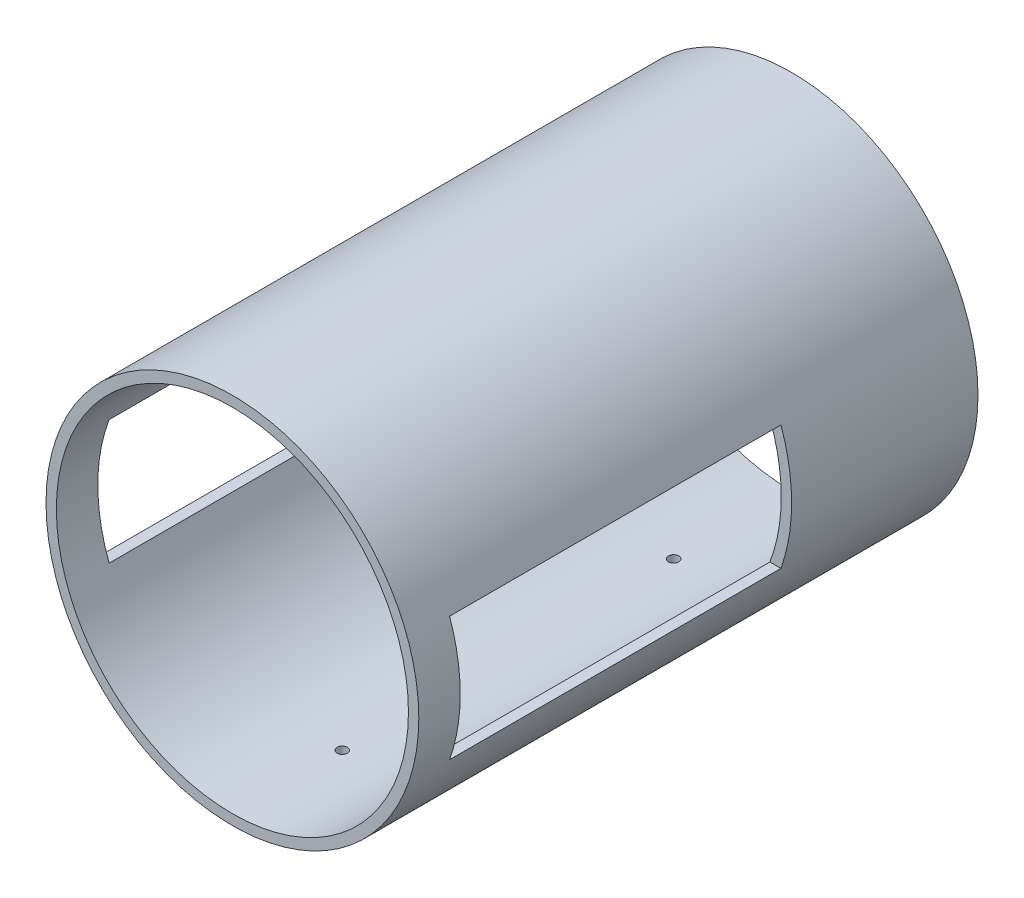
ISO-10303-21;
HEADER;
FILE_DESCRIPTION(('STEP AP214'),'2;1');
FILE_NAME('part.step','',(''),(''),'','','');
FILE_SCHEMA(('AUTOMOTIVE_DESIGN { 1 0 10303 214 1 1 1 1 }'));
ENDSEC;
DATA;
#1=APPLICATION_CONTEXT('core data for automotive mechanical design processes');
#2=APPLICATION_PROTOCOL_DEFINITION('international standard','automotive_design',2000,#1);
#3=PRODUCT_CONTEXT('',#1,'mechanical');
#4=PRODUCT('Part','Part','',(#3));
#5=PRODUCT_RELATED_PRODUCT_CATEGORY('part','',(#4));
#6=PRODUCT_DEFINITION_FORMATION('','',#4);
#7=PRODUCT_DEFINITION_CONTEXT('part definition',#1,'design');
#8=PRODUCT_DEFINITION('design','',#6,#7);
#9=PRODUCT_DEFINITION_SHAPE('','',#8);
#10=(LENGTH_UNIT() NAMED_UNIT(*) SI_UNIT(.MILLI.,.METRE.));
#11=(NAMED_UNIT(*) PLANE_ANGLE_UNIT() SI_UNIT($,.RADIAN.));
#12=(NAMED_UNIT(*) SI_UNIT($,.STERADIAN.) SOLID_ANGLE_UNIT());
#13=UNCERTAINTY_MEASURE_WITH_UNIT(LENGTH_MEASURE(1.E-05),#10,'distance_accuracy_value','');
#14=(GEOMETRIC_REPRESENTATION_CONTEXT(3) GLOBAL_UNCERTAINTY_ASSIGNED_CONTEXT((#13)) GLOBAL_UNIT_ASSIGNED_CONTEXT((#10,
#11,#12)) REPRESENTATION_CONTEXT('',''));
#15=CARTESIAN_POINT('',(0.,0.,0.));
#16=DIRECTION('',(0.,0.,1.));
#17=DIRECTION('',(1.,0.,0.));
#18=AXIS2_PLACEMENT_3D('',#15,#16,#17);
#19=CARTESIAN_POINT('',(0.,0.,270.));
#20=DIRECTION('',(0.,0.,1.));
#21=DIRECTION('',(1.,0.,0.));
#22=AXIS2_PLACEMENT_3D('',#19,#20,#21);
#23=PLANE('',#22);
#24=CARTESIAN_POINT('',(0.,0.,270.));
#25=DIRECTION('',(0.,0.,1.));
#26=DIRECTION('',(1.,0.,0.));
#27=AXIS2_PLACEMENT_3D('',#24,#25,#26);
#28=CIRCLE('',#27,90.);
#29=CARTESIAN_POINT('',(90.,0.,270.));
#30=VERTEX_POINT('',#29);
#31=EDGE_CURVE('E125',#30,#30,#28,.T.);
#32=ORIENTED_EDGE('',*,*,#31,.T.);
#33=EDGE_LOOP('',(#32));
#34=FACE_BOUND('',#33,.T.);
#35=CARTESIAN_POINT('',(0.,0.,270.));
#36=DIRECTION('',(0.,0.,1.));
#37=DIRECTION('',(1.,0.,0.));
#38=AXIS2_PLACEMENT_3D('',#35,#36,#37);
#39=CIRCLE('',#38,85.);
#40=CARTESIAN_POINT('',(85.,0.,270.));
#41=VERTEX_POINT('',#40);
#42=EDGE_CURVE('E229',#41,#41,#39,.T.);
#43=ORIENTED_EDGE('',*,*,#42,.F.);
#44=EDGE_LOOP('',(#43));
#45=FACE_BOUND('',#44,.T.);
#46=ADVANCED_FACE('F41',(#34,#45),#23,.T.);
#47=CARTESIAN_POINT('',(0.,0.,0.));
#48=DIRECTION('',(0.,0.,1.));
#49=DIRECTION('',(1.,0.,0.));
#50=AXIS2_PLACEMENT_3D('',#47,#48,#49);
#51=PLANE('',#50);
#52=CARTESIAN_POINT('',(0.,0.,0.));
#53=DIRECTION('',(0.,0.,1.));
#54=DIRECTION('',(1.,0.,0.));
#55=AXIS2_PLACEMENT_3D('',#52,#53,#54);
#56=CIRCLE('',#55,90.);
#57=CARTESIAN_POINT('',(90.,0.,0.));
#58=VERTEX_POINT('',#57);
#59=EDGE_CURVE('E233',#58,#58,#56,.T.);
#60=ORIENTED_EDGE('',*,*,#59,.F.);
#61=EDGE_LOOP('',(#60));
#62=FACE_BOUND('',#61,.T.);
#63=CARTESIAN_POINT('',(0.,0.,0.));
#64=DIRECTION('',(0.,0.,1.));
#65=DIRECTION('',(1.,0.,0.));
#66=AXIS2_PLACEMENT_3D('',#63,#64,#65);
#67=CIRCLE('',#66,85.);
#68=CARTESIAN_POINT('',(85.,0.,0.));
#69=VERTEX_POINT('',#68);
#70=EDGE_CURVE('E234',#69,#69,#67,.T.);
#71=ORIENTED_EDGE('',*,*,#70,.T.);
#72=EDGE_LOOP('',(#71));
#73=FACE_BOUND('',#72,.T.);
#74=ADVANCED_FACE('F246',(#62,#73),#51,.F.);
#75=CARTESIAN_POINT('',(0.,0.,270.));
#76=DIRECTION('',(0.,0.,-1.));
#77=DIRECTION('',(-1.,0.,0.));
#78=AXIS2_PLACEMENT_3D('',#75,#76,#77);
#79=CYLINDRICAL_SURFACE('',#78,90.);
#80=CARTESIAN_POINT('',(0.,-90.,219.435514150279));
#81=CARTESIAN_POINT('',(0.140397042019154,-89.9999995319438,219.435507933143));
#82=CARTESIAN_POINT('',(0.28089519564269,-89.9996679531089,219.423647656676));
#83=CARTESIAN_POINT('',(0.558020117815433,-89.9983770952561,219.37650036));
#84=CARTESIAN_POINT('',(0.694642052959803,-89.9974170656467,219.341185325815));
#85=CARTESIAN_POINT('',(0.959959719018595,-89.9949780319742,219.248136415119));
#86=CARTESIAN_POINT('',(1.08865927892479,-89.9934992809682,219.1904134688));
#87=CARTESIAN_POINT('',(1.33450554505353,-89.99018962507,219.054202859385));
#88=CARTESIAN_POINT('',(1.45165506934499,-89.9883588064013,218.975720278684));
#89=CARTESIAN_POINT('',(1.6711601515117,-89.9845503358166,218.800179991348));
#90=CARTESIAN_POINT('',(1.77351058430538,-89.9825726333905,218.703115876647));
#91=CARTESIAN_POINT('',(1.96046913805617,-89.9786937420702,218.493178643787));
#92=CARTESIAN_POINT('',(2.04507655381373,-89.9767925562195,218.380304897569));
#93=CARTESIAN_POINT('',(2.19415412545861,-89.9732808620878,218.141935059623));
#94=CARTESIAN_POINT('',(2.25862139660069,-89.9716703954613,218.016437163092));
#95=CARTESIAN_POINT('',(2.36556983153641,-89.9689221774994,217.756394356945));
#96=CARTESIAN_POINT('',(2.40805107723982,-89.9677844244029,217.621849481036));
#97=CARTESIAN_POINT('',(2.46981108294208,-89.9661102723468,217.347568890308));
#98=CARTESIAN_POINT('',(2.48909586382638,-89.9655737173425,217.207834532185));
#99=CARTESIAN_POINT('',(2.5039340546256,-89.9651619902208,216.927110864151));
#100=CARTESIAN_POINT('',(2.49948755185745,-89.9652868156701,216.786121558858));
#101=CARTESIAN_POINT('',(2.46699450942354,-89.9661836277688,216.506931018646));
#102=CARTESIAN_POINT('',(2.43895448450627,-89.9669554357703,216.368729024867));
#103=CARTESIAN_POINT('',(2.36008042398483,-89.9690589248205,216.09899462342));
#104=CARTESIAN_POINT('',(2.30924634192171,-89.9703906070103,215.967462229346));
#105=CARTESIAN_POINT('',(2.18621968912266,-89.9734639286712,215.714779840415));
#106=CARTESIAN_POINT('',(2.11402413154512,-89.9752056254652,215.593631300525));
#107=CARTESIAN_POINT('',(1.95032613265887,-89.9789025714567,215.365171574372));
#108=CARTESIAN_POINT('',(1.8588236546426,-89.9808578210603,215.25786041442));
#109=CARTESIAN_POINT('',(1.65907237374858,-89.9847622498809,215.060083657521));
#110=CARTESIAN_POINT('',(1.5508179195768,-89.9867114268222,214.969623768145));
#111=CARTESIAN_POINT('',(1.32065559128939,-89.9903833377234,214.808161334606));
#112=CARTESIAN_POINT('',(1.19874771503101,-89.9921060716479,214.737158793496));
#113=CARTESIAN_POINT('',(0.944735932127739,-89.9951309143508,214.61662722284));
#114=CARTESIAN_POINT('',(0.812631941112758,-89.9964330196482,214.567098371006));
#115=CARTESIAN_POINT('',(0.541979331555829,-89.9984697645758,214.490923769161));
#116=CARTESIAN_POINT('',(0.403430728095552,-89.999204405534,214.464277965602));
#117=CARTESIAN_POINT('',(0.1238714065411,-90.0000232385431,214.434632832222));
#118=CARTESIAN_POINT('',(-0.017138473529515,-90.0001076478185,214.431625605403));
#119=CARTESIAN_POINT('',(-0.297661115566697,-89.9996170775789,214.449322413365));
#120=CARTESIAN_POINT('',(-0.437173879010674,-89.9990420987148,214.470026424745));
#121=CARTESIAN_POINT('',(-0.710719991671809,-89.9972976964564,214.534551458711));
#122=CARTESIAN_POINT('',(-0.844754186879518,-89.9961283652185,214.578368897522));
#123=CARTESIAN_POINT('',(-1.10356435792478,-89.9933270338481,214.687873322448));
#124=CARTESIAN_POINT('',(-1.22834031798408,-89.9916950329273,214.753560345834));
#125=CARTESIAN_POINT('',(-1.46512841707063,-89.9881516893817,214.904959655067));
#126=CARTESIAN_POINT('',(-1.57713715604541,-89.9862402726533,214.990677256827));
#127=CARTESIAN_POINT('',(-1.78517713978239,-89.9823537725011,215.179696699419));
#128=CARTESIAN_POINT('',(-1.88120834863079,-89.9803786889342,215.282998579773));
#129=CARTESIAN_POINT('',(-2.05459362740716,-89.9765868967821,215.504288031401));
#130=CARTESIAN_POINT('',(-2.13194260177604,-89.9747702314915,215.622279596));
#131=CARTESIAN_POINT('',(-2.26573289500017,-89.9715007780743,215.869578633912));
#132=CARTESIAN_POINT('',(-2.32217425739509,-89.9700479891899,215.998886083659));
#133=CARTESIAN_POINT('',(-2.41253824343585,-89.9676703956174,216.265127115878));
#134=CARTESIAN_POINT('',(-2.4464641689408,-89.9667455135152,216.402059576959));
#135=CARTESIAN_POINT('',(-2.49084507773953,-89.9655277935085,216.679679548046));
#136=CARTESIAN_POINT('',(-2.50130007269339,-89.9652349552901,216.820367056186));
#137=CARTESIAN_POINT('',(-2.49844194655691,-89.96531436789,217.101452416446));
#138=CARTESIAN_POINT('',(-2.4851368682369,-89.9656863936522,217.241850350483));
#139=CARTESIAN_POINT('',(-2.4351528030252,-89.9670531219144,217.518418947146));
#140=CARTESIAN_POINT('',(-2.39847376968867,-89.9680478256517,217.654589601372));
#141=CARTESIAN_POINT('',(-2.30278395447145,-89.9705477446442,217.918841651203));
#142=CARTESIAN_POINT('',(-2.24377279020737,-89.9720529686408,218.046922908252));
#143=CARTESIAN_POINT('',(-2.10509696337443,-89.9754041734411,218.29135727779));
#144=CARTESIAN_POINT('',(-2.02543305682351,-89.9772501417709,218.40771081937));
#145=CARTESIAN_POINT('',(-1.84769084148879,-89.9810753429325,218.625422993322));
#146=CARTESIAN_POINT('',(-1.74960826485271,-89.9830546065823,218.726778140613));
#147=CARTESIAN_POINT('',(-1.5377908144063,-89.9869234655456,218.911610946133));
#148=CARTESIAN_POINT('',(-1.42405206882742,-89.9888130385225,218.99508416907));
#149=CARTESIAN_POINT('',(-1.18410995481811,-89.992290110815,219.141795849157));
#150=CARTESIAN_POINT('',(-1.05789885588763,-89.9938774209784,219.20502165249));
#151=CARTESIAN_POINT('',(-0.796746320585507,-89.996567579422,219.309312727654));
#152=CARTESIAN_POINT('',(-0.66181551949931,-89.9976710055542,219.350404445371));
#153=CARTESIAN_POINT('',(-0.438359413069992,-89.9989739129089,219.398362357061));
#154=CARTESIAN_POINT('',(-0.351284744204209,-89.9993570277234,219.412276769779));
#155=CARTESIAN_POINT('',(-0.176153320392806,-89.9998702180854,219.430854615793));
#156=CARTESIAN_POINT('',(-0.0880965656943918,-90.0000002936967,219.435518051418));
#157=CARTESIAN_POINT('',(0.,-90.,219.435514150279));
#158=B_SPLINE_CURVE_WITH_KNOTS('',3,(#80,#81,#82,#83,#84,#85,#86,#87,#88,#89,#90,#91,#92,#93,
#94,#95,#96,#97,#98,#99,#100,#101,#102,#103,#104,#105,#106,#107,#108,#109,#110,#111,#112,#113,
#114,#115,#116,#117,#118,#119,#120,#121,#122,#123,#124,#125,#126,#127,#128,#129,#130,#131,#132,
#133,#134,#135,#136,#137,#138,#139,#140,#141,#142,#143,#144,#145,#146,#147,#148,#149,#150,#151,
#152,#153,#154,#155,#156,#157),.UNSPECIFIED.,.T.,.F.,(4,2,2,2,2,2,2,2,2,2,2,2,2,2,2,2,2,2,2,2,2,
2,2,2,2,2,2,2,2,2,2,2,2,2,2,2,2,2,4),(0.,0.42086956381158,0.842242713432001,1.26341058226418,
1.68447543560223,2.10568576067631,2.52691282366281,2.94820019288202,3.36948599256813,
3.79066241949896,4.2118372967533,4.6328959154729,5.05395539239963,5.47507377128557,
5.89619295083596,6.31745450627262,6.7387161278217,7.15998123557068,7.58124535752536,
8.0023687407638,8.42349170838378,8.84454939937653,9.26560780793642,9.6867780883187,
10.1079493153823,10.5292352870451,10.9505203813834,11.3717436811591,11.7929667716759,
12.2140473054589,12.6351286759459,13.0562172567528,13.4772904252921,13.898461282779,
14.3197364835173,14.7412744527206,15.1623076433261,15.4263956324784,15.6904835551573),.UNSPECIFIED.);
#159=CARTESIAN_POINT('',(0.,-90.,219.435514150279));
#160=VERTEX_POINT('',#159);
#161=EDGE_CURVE('E188',#160,#160,#158,.T.);
#162=ORIENTED_EDGE('',*,*,#161,.T.);
#163=EDGE_LOOP('',(#162));
#164=FACE_BOUND('',#163,.T.);
#165=CARTESIAN_POINT('',(0.,-90.,59.4355141502788));
#166=CARTESIAN_POINT('',(0.140397042019179,-89.9999995319438,59.4355079331427));
#167=CARTESIAN_POINT('',(0.280895195642714,-89.9996679531089,59.4236476566764));
#168=CARTESIAN_POINT('',(0.558020117815458,-89.9983770952561,59.3765003599996));
#169=CARTESIAN_POINT('',(0.694642052959831,-89.9974170656467,59.3411853258147));
#170=CARTESIAN_POINT('',(0.959959719018621,-89.9949780319742,59.248136415119));
#171=CARTESIAN_POINT('',(1.08865927892481,-89.9934992809682,59.1904134688002));
#172=CARTESIAN_POINT('',(1.33450554505355,-89.99018962507,59.0542028593846));
#173=CARTESIAN_POINT('',(1.45165506934501,-89.9883588064013,58.9757202786841));
#174=CARTESIAN_POINT('',(1.67116015151172,-89.9845503358166,58.8001799913483));
#175=CARTESIAN_POINT('',(1.77351058430539,-89.9825726333905,58.703115876647));
#176=CARTESIAN_POINT('',(1.96046913805619,-89.9786937420702,58.4931786437872));
#177=CARTESIAN_POINT('',(2.04507655381375,-89.9767925562195,58.3803048975693));
#178=CARTESIAN_POINT('',(2.19415412545864,-89.9732808620878,58.1419350596226));
#179=CARTESIAN_POINT('',(2.25862139660071,-89.9716703954613,58.0164371630917));
#180=CARTESIAN_POINT('',(2.36556983153643,-89.9689221774994,57.756394356945));
#181=CARTESIAN_POINT('',(2.40805107723984,-89.9677844244029,57.6218494810362));
#182=CARTESIAN_POINT('',(2.46981108294211,-89.9661102723468,57.3475688903084));
#183=CARTESIAN_POINT('',(2.48909586382641,-89.9655737173425,57.2078345321853));
#184=CARTESIAN_POINT('',(2.50393405462562,-89.9651619902208,56.9271108641506));
#185=CARTESIAN_POINT('',(2.49948755185748,-89.9652868156701,56.7861215588583));
#186=CARTESIAN_POINT('',(2.46699450942357,-89.9661836277688,56.5069310186462));
#187=CARTESIAN_POINT('',(2.4389544845063,-89.9669554357703,56.3687290248672));
#188=CARTESIAN_POINT('',(2.36008042398485,-89.9690589248205,56.0989946234199));
#189=CARTESIAN_POINT('',(2.30924634192173,-89.9703906070103,55.9674622293463));
#190=CARTESIAN_POINT('',(2.18621968912268,-89.9734639286712,55.7147798404153));
#191=CARTESIAN_POINT('',(2.11402413154515,-89.9752056254652,55.5936313005246));
#192=CARTESIAN_POINT('',(1.9503261326589,-89.9789025714567,55.3651715743723));
#193=CARTESIAN_POINT('',(1.85882365464264,-89.9808578210603,55.2578604144198));
#194=CARTESIAN_POINT('',(1.65907237374862,-89.9847622498809,55.0600836575209));
#195=CARTESIAN_POINT('',(1.55081791957684,-89.9867114268221,54.969623768145));
#196=CARTESIAN_POINT('',(1.32065559128943,-89.9903833377234,54.8081613346056));
#197=CARTESIAN_POINT('',(1.19874771503104,-89.9921060716479,54.7371587934956));
#198=CARTESIAN_POINT('',(0.944735932127776,-89.9951309143508,54.6166272228401));
#199=CARTESIAN_POINT('',(0.812631941112797,-89.9964330196482,54.5670983710059));
#200=CARTESIAN_POINT('',(0.541979331555867,-89.9984697645758,54.490923769161));
#201=CARTESIAN_POINT('',(0.403430728095588,-89.999204405534,54.4642779656022));
#202=CARTESIAN_POINT('',(0.123871406541134,-90.0000232385431,54.4346328322216));
#203=CARTESIAN_POINT('',(-0.0171384735294825,-90.0001076478185,54.4316256054028));
#204=CARTESIAN_POINT('',(-0.297661115566666,-89.9996170775789,54.4493224133654));
#205=CARTESIAN_POINT('',(-0.437173879010643,-89.9990420987148,54.4700264247455));
#206=CARTESIAN_POINT('',(-0.710719991671778,-89.9972976964564,54.5345514587113));
#207=CARTESIAN_POINT('',(-0.844754186879487,-89.9961283652185,54.5783688975219));
#208=CARTESIAN_POINT('',(-1.10356435792475,-89.9933270338481,54.6878733224483));
#209=CARTESIAN_POINT('',(-1.22834031798405,-89.9916950329273,54.7535603458341));
#210=CARTESIAN_POINT('',(-1.4651284170706,-89.9881516893817,54.9049596550668));
#211=CARTESIAN_POINT('',(-1.57713715604537,-89.9862402726533,54.9906772568275));
#212=CARTESIAN_POINT('',(-1.78517713978236,-89.9823537725011,55.1796966994186));
#213=CARTESIAN_POINT('',(-1.88120834863076,-89.9803786889342,55.2829985797734));
#214=CARTESIAN_POINT('',(-2.05459362740713,-89.9765868967821,55.5042880314008));
#215=CARTESIAN_POINT('',(-2.13194260177601,-89.9747702314915,55.6222795960003));
#216=CARTESIAN_POINT('',(-2.26573289500014,-89.9715007780743,55.869578633912));
#217=CARTESIAN_POINT('',(-2.32217425739506,-89.9700479891899,55.9988860836586));
#218=CARTESIAN_POINT('',(-2.41253824343582,-89.9676703956174,56.2651271158778));
#219=CARTESIAN_POINT('',(-2.44646416894077,-89.9667455135152,56.402059576959));
#220=CARTESIAN_POINT('',(-2.4908450777395,-89.9655277935085,56.6796795480457));
#221=CARTESIAN_POINT('',(-2.50130007269336,-89.9652349552901,56.8203670561858));
#222=CARTESIAN_POINT('',(-2.49844194655688,-89.96531436789,57.1014524164465));
#223=CARTESIAN_POINT('',(-2.48513686823687,-89.9656863936522,57.2418503504828));
#224=CARTESIAN_POINT('',(-2.43515280302518,-89.9670531219144,57.5184189471457));
#225=CARTESIAN_POINT('',(-2.39847376968864,-89.9680478256517,57.654589601372));
#226=CARTESIAN_POINT('',(-2.30278395447142,-89.9705477446442,57.9188416512026));
#227=CARTESIAN_POINT('',(-2.24377279020734,-89.9720529686408,58.0469229082518));
#228=CARTESIAN_POINT('',(-2.1050969633744,-89.9754041734411,58.2913572777903));
#229=CARTESIAN_POINT('',(-2.02543305682349,-89.9772501417709,58.4077108193699));
#230=CARTESIAN_POINT('',(-1.84769084148878,-89.9810753429325,58.6254229933216));
#231=CARTESIAN_POINT('',(-1.74960826485269,-89.9830546065823,58.7267781406132));
#232=CARTESIAN_POINT('',(-1.53779081440628,-89.9869234655456,58.9116109461328));
#233=CARTESIAN_POINT('',(-1.42405206882739,-89.9888130385225,58.9950841690696));
#234=CARTESIAN_POINT('',(-1.18410995481808,-89.992290110815,59.1417958491572));
#235=CARTESIAN_POINT('',(-1.0578988558876,-89.9938774209784,59.2050216524902));
#236=CARTESIAN_POINT('',(-0.796746320585478,-89.996567579422,59.3093127276544));
#237=CARTESIAN_POINT('',(-0.661815519499278,-89.9976710055542,59.3504044453708));
#238=CARTESIAN_POINT('',(-0.43835941306996,-89.9989739129089,59.3983623570611));
#239=CARTESIAN_POINT('',(-0.351284744204177,-89.9993570277234,59.4122767697793));
#240=CARTESIAN_POINT('',(-0.176153320392776,-89.9998702180854,59.4308546157932));
#241=CARTESIAN_POINT('',(-0.0880965656943635,-90.0000002936967,59.4355180514176));
#242=CARTESIAN_POINT('',(0.,-90.,59.4355141502788));
#243=B_SPLINE_CURVE_WITH_KNOTS('',3,(#165,#166,#167,#168,#169,#170,#171,#172,#173,#174,#175,
#176,#177,#178,#179,#180,#181,#182,#183,#184,#185,#186,#187,#188,#189,#190,#191,#192,#193,#194,
#195,#196,#197,#198,#199,#200,#201,#202,#203,#204,#205,#206,#207,#208,#209,#210,#211,#212,#213,
#214,#215,#216,#217,#218,#219,#220,#221,#222,#223,#224,#225,#226,#227,#228,#229,#230,#231,#232,
#233,#234,#235,#236,#237,#238,#239,#240,#241,#242),.UNSPECIFIED.,.T.,.F.,(4,2,2,2,2,2,2,2,2,2,2,
2,2,2,2,2,2,2,2,2,2,2,2,2,2,2,2,2,2,2,2,2,2,2,2,2,2,2,4),(0.,0.420869563811578,
0.842242713431999,1.26341058226417,1.68447543560222,2.10568576067627,2.52691282366281,
2.94820019288202,3.36948599256812,3.79066241949895,4.21183729675328,4.63289591547289,
5.05395539239966,5.47507377128554,5.89619295083594,6.3174545062726,6.73871612782169,
7.15998123557066,7.58124535752535,8.00236874076379,8.42349170838378,8.84454939937653,
9.26560780793641,9.68677808831869,10.1079493153823,10.529235287045,10.9505203813834,
11.3717436811591,11.7929667716759,12.2140473054589,12.6351286759459,13.0562172567528,
13.4772904252921,13.898461282779,14.3197364835173,14.7412744527206,15.1623076433261,
15.4263956324784,15.6904835551572),.UNSPECIFIED.);
#244=CARTESIAN_POINT('',(0.,-90.,59.4355141502788));
#245=VERTEX_POINT('',#244);
#246=EDGE_CURVE('E166',#245,#245,#243,.T.);
#247=ORIENTED_EDGE('',*,*,#246,.T.);
#248=EDGE_LOOP('',(#247));
#249=FACE_BOUND('',#248,.T.);
#250=DIRECTION('',(0.,0.,-1.));
#251=VECTOR('',#250,1.);
#252=CARTESIAN_POINT('',(-84.8528137423857,30.,270.));
#253=LINE('',#252,#251);
#254=CARTESIAN_POINT('',(-84.8528137423857,30.,90.));
#255=VERTEX_POINT('',#254);
#256=CARTESIAN_POINT('',(-84.8528137423857,30.,250.));
#257=VERTEX_POINT('',#256);
#258=EDGE_CURVE('E207',#255,#257,#253,.F.);
#259=ORIENTED_EDGE('',*,*,#258,.T.);
#260=CARTESIAN_POINT('',(0.,0.,250.));
#261=DIRECTION('',(0.,0.,1.));
#262=DIRECTION('',(1.,0.,0.));
#263=AXIS2_PLACEMENT_3D('',#260,#261,#262);
#264=CIRCLE('',#263,90.);
#265=CARTESIAN_POINT('',(-84.8528137423857,-30.,250.));
#266=VERTEX_POINT('',#265);
#267=EDGE_CURVE('E131',#257,#266,#264,.T.);
#268=ORIENTED_EDGE('',*,*,#267,.T.);
#269=DIRECTION('',(0.,0.,-1.));
#270=VECTOR('',#269,1.);
#271=CARTESIAN_POINT('',(-84.8528137423857,-30.,270.));
#272=LINE('',#271,#270);
#273=CARTESIAN_POINT('',(-84.8528137423857,-30.,90.));
#274=VERTEX_POINT('',#273);
#275=EDGE_CURVE('E221',#266,#274,#272,.T.);
#276=ORIENTED_EDGE('',*,*,#275,.T.);
#277=CARTESIAN_POINT('',(0.,0.,90.));
#278=DIRECTION('',(0.,0.,-1.));
#279=DIRECTION('',(-1.,0.,0.));
#280=AXIS2_PLACEMENT_3D('',#277,#278,#279);
#281=CIRCLE('',#280,90.);
#282=EDGE_CURVE('E225',#274,#255,#281,.T.);
#283=ORIENTED_EDGE('',*,*,#282,.T.);
#284=EDGE_LOOP('',(#259,#268,#276,#283));
#285=FACE_BOUND('',#284,.T.);
#286=CARTESIAN_POINT('',(84.8528137423857,-30.,250.));
#287=VERTEX_POINT('',#286);
#288=CARTESIAN_POINT('',(84.8528137423857,30.,250.));
#289=VERTEX_POINT('',#288);
#290=EDGE_CURVE('E214',#287,#289,#264,.T.);
#291=ORIENTED_EDGE('',*,*,#290,.T.);
#292=DIRECTION('',(0.,0.,-1.));
#293=VECTOR('',#292,1.);
#294=CARTESIAN_POINT('',(84.8528137423857,30.,270.));
#295=LINE('',#294,#293);
#296=CARTESIAN_POINT('',(84.8528137423857,30.,90.));
#297=VERTEX_POINT('',#296);
#298=EDGE_CURVE('E210',#289,#297,#295,.T.);
#299=ORIENTED_EDGE('',*,*,#298,.T.);
#300=CARTESIAN_POINT('',(84.8528137423857,-30.,90.));
#301=VERTEX_POINT('',#300);
#302=EDGE_CURVE('E228',#297,#301,#281,.T.);
#303=ORIENTED_EDGE('',*,*,#302,.T.);
#304=DIRECTION('',(0.,0.,-1.));
#305=VECTOR('',#304,1.);
#306=CARTESIAN_POINT('',(84.8528137423857,-30.,270.));
#307=LINE('',#306,#305);
#308=EDGE_CURVE('E217',#301,#287,#307,.F.);
#309=ORIENTED_EDGE('',*,*,#308,.T.);
#310=EDGE_LOOP('',(#291,#299,#303,#309));
#311=FACE_BOUND('',#310,.T.);
#312=ORIENTED_EDGE('',*,*,#31,.F.);
#313=EDGE_LOOP('',(#312));
#314=FACE_BOUND('',#313,.T.);
#315=ORIENTED_EDGE('',*,*,#59,.T.);
#316=EDGE_LOOP('',(#315));
#317=FACE_BOUND('',#316,.T.);
#318=ADVANCED_FACE('F43',(#164,#249,#285,#311,#314,#317),#79,.T.);
#319=CARTESIAN_POINT('',(0.,0.,270.));
#320=DIRECTION('',(0.,0.,-1.));
#321=DIRECTION('',(-1.,0.,0.));
#322=AXIS2_PLACEMENT_3D('',#319,#320,#321);
#323=CYLINDRICAL_SURFACE('',#322,85.);
#324=CARTESIAN_POINT('',(0.,-85.,219.435514150279));
#325=CARTESIAN_POINT('',(0.140393524378718,-84.9999995046087,219.435507934379));
#326=CARTESIAN_POINT('',(0.280888074295993,-84.9996484389132,219.423648249884));
#327=CARTESIAN_POINT('',(0.558005647093424,-84.9982817174873,219.376503441611));
#328=CARTESIAN_POINT('',(0.6946238404061,-84.9972652676845,219.341190327673));
#329=CARTESIAN_POINT('',(0.959934004017298,-84.9946828896954,219.248146817463));
#330=CARTESIAN_POINT('',(1.08862981263497,-84.9931172300984,219.190427377466));
#331=CARTESIAN_POINT('',(1.33446931951486,-84.9896130414957,219.054225346306));
#332=CARTESIAN_POINT('',(1.45161583025469,-84.9876746036098,218.975747827367));
#333=CARTESIAN_POINT('',(1.67111944140127,-84.9836421661362,218.800216378568));
#334=CARTESIAN_POINT('',(1.77347098481321,-84.9815481085425,218.703155500447));
#335=CARTESIAN_POINT('',(1.96043256823564,-84.9774409572996,218.493224549413));
#336=CARTESIAN_POINT('',(2.04504190204469,-84.9754278668758,218.380353847515));
#337=CARTESIAN_POINT('',(2.19412564280934,-84.971709380369,218.141987057607));
#338=CARTESIAN_POINT('',(2.25859676954662,-84.9700040344322,218.016488917171));
#339=CARTESIAN_POINT('',(2.36555262144571,-84.9670938648566,217.75644432575));
#340=CARTESIAN_POINT('',(2.40803743309319,-84.965889039249,217.621897910359));
#341=CARTESIAN_POINT('',(2.46980287379754,-84.9641161803548,217.34761750535));
#342=CARTESIAN_POINT('',(2.48909025786776,-84.9635479616936,217.207885038117));
#343=CARTESIAN_POINT('',(2.50393415065727,-84.9631118280154,216.927164579524));
#344=CARTESIAN_POINT('',(2.4994907520903,-84.9632439102623,216.786176593071));
#345=CARTESIAN_POINT('',(2.46700493241115,-84.964193311098,216.506993058965));
#346=CARTESIAN_POINT('',(2.43896981673905,-84.9650104175611,216.368796660429));
#347=CARTESIAN_POINT('',(2.36010767528186,-84.9672374203735,216.099072623631));
#348=CARTESIAN_POINT('',(2.30928060033579,-84.9686473180014,215.967544999755));
#349=CARTESIAN_POINT('',(2.18626895522427,-84.9719012105581,215.714868626174));
#350=CARTESIAN_POINT('',(2.11408103649143,-84.9737452735381,215.59372150758));
#351=CARTESIAN_POINT('',(1.95039935241671,-84.9776595432146,215.36526298009));
#352=CARTESIAN_POINT('',(1.85890554498096,-84.9797297504042,215.257951601361));
#353=CARTESIAN_POINT('',(1.65916792957406,-84.9838638777928,215.060168168089));
#354=CARTESIAN_POINT('',(1.55091778578672,-84.9859277953115,214.969702511782));
#355=CARTESIAN_POINT('',(1.32076268672098,-84.9898159191188,214.808227785574));
#356=CARTESIAN_POINT('',(1.19885772924848,-84.9916401253689,214.737218718799));
#357=CARTESIAN_POINT('',(0.94484990976242,-84.9948432124487,214.616673591062));
#358=CARTESIAN_POINT('',(0.81274695249688,-84.9962220891182,214.567137730692));
#359=CARTESIAN_POINT('',(0.54209467692989,-84.9983790138624,214.490949248888));
#360=CARTESIAN_POINT('',(0.403545375506728,-84.99915706351,214.464296567542));
#361=CARTESIAN_POINT('',(0.123988938954878,-85.000024427324,214.434638858802));
#362=CARTESIAN_POINT('',(-0.017017256240174,-85.0001139993243,214.4316249787));
#363=CARTESIAN_POINT('',(-0.297533629735388,-84.9995949937803,214.449307356835));
#364=CARTESIAN_POINT('',(-0.437043809699055,-84.9989864170123,214.470003588704));
#365=CARTESIAN_POINT('',(-0.71058326526739,-84.9971398685405,214.534511370932));
#366=CARTESIAN_POINT('',(-0.844613489435591,-84.9959020062667,214.578318902388));
#367=CARTESIAN_POINT('',(-1.10341750203545,-84.992936378084,214.687801662257));
#368=CARTESIAN_POINT('',(-1.22819127264489,-84.991208611232,214.753476932771));
#369=CARTESIAN_POINT('',(-1.46498123802067,-84.9874571731599,214.904853677523));
#370=CARTESIAN_POINT('',(-1.5769936224216,-84.9854334139707,214.990561109885));
#371=CARTESIAN_POINT('',(-1.78504291778981,-84.9813183650636,215.179560504158));
#372=CARTESIAN_POINT('',(-1.88107978927005,-84.9792270751788,215.282852509532));
#373=CARTESIAN_POINT('',(-2.05448146308617,-84.9752119890713,215.504126888893));
#374=CARTESIAN_POINT('',(-2.13184055281938,-84.973288244207,215.622113740619));
#375=CARTESIAN_POINT('',(-2.26565165005376,-84.9698259509516,215.869405718671));
#376=CARTESIAN_POINT('',(-2.32210370368157,-84.9682874017106,215.998710820025));
#377=CARTESIAN_POINT('',(-2.41248825841417,-84.9657693348592,216.264947282662));
#378=CARTESIAN_POINT('',(-2.44642445761801,-84.9647897254499,216.401877387575));
#379=CARTESIAN_POINT('',(-2.49082610452918,-84.9634997290064,216.679494730472));
#380=CARTESIAN_POINT('',(-2.50129157044439,-84.963189341453,216.820181965542));
#381=CARTESIAN_POINT('',(-2.49845424187916,-84.9632728173662,217.101262750383));
#382=CARTESIAN_POINT('',(-2.4851604596561,-84.9636664138006,217.241656391296));
#383=CARTESIAN_POINT('',(-2.4352005252155,-84.9651129256759,217.518218228123));
#384=CARTESIAN_POINT('',(-2.39853432663588,-84.9661658424245,217.654386415654));
#385=CARTESIAN_POINT('',(-2.30287157861962,-84.9688122595352,217.918635572918));
#386=CARTESIAN_POINT('',(-2.24387465356548,-84.9704057689903,218.046716406574));
#387=CARTESIAN_POINT('',(-2.10522837096703,-84.9739536634928,218.291152562135));
#388=CARTESIAN_POINT('',(-2.02557976276147,-84.9759080354457,218.407508309266));
#389=CARTESIAN_POINT('',(-1.84786492977962,-84.9799580775022,218.625232536078));
#390=CARTESIAN_POINT('',(-1.74979368738697,-84.9820537860005,218.726596919212));
#391=CARTESIAN_POINT('',(-1.53799721863001,-84.986150390389,218.911450223605));
#392=CARTESIAN_POINT('',(-1.42426812157843,-84.9881512626704,218.994934711798));
#393=CARTESIAN_POINT('',(-1.18434076631099,-84.9918333227626,219.141672059435));
#394=CARTESIAN_POINT('',(-1.05813455489749,-84.9935143046453,219.204911904229));
#395=CARTESIAN_POINT('',(-0.796988637653374,-84.9963633884489,219.309231516562));
#396=CARTESIAN_POINT('',(-0.66205956488956,-84.9975321017797,219.350337714829));
#397=CARTESIAN_POINT('',(-0.438564897759322,-84.9989125335872,219.398327261096));
#398=CARTESIAN_POINT('',(-0.351450023475598,-84.9993185645565,219.412254803365));
#399=CARTESIAN_POINT('',(-0.17623670486416,-84.9998624532269,219.430850197801));
#400=CARTESIAN_POINT('',(-0.0881382608146928,-85.0000003110039,219.435518052586));
#401=CARTESIAN_POINT('',(0.,-85.,219.435514150279));
#402=B_SPLINE_CURVE_WITH_KNOTS('',3,(#324,#325,#326,#327,#328,#329,#330,#331,#332,#333,#334,
#335,#336,#337,#338,#339,#340,#341,#342,#343,#344,#345,#346,#347,#348,#349,#350,#351,#352,#353,
#354,#355,#356,#357,#358,#359,#360,#361,#362,#363,#364,#365,#366,#367,#368,#369,#370,#371,#372,
#373,#374,#375,#376,#377,#378,#379,#380,#381,#382,#383,#384,#385,#386,#387,#388,#389,#390,#391,
#392,#393,#394,#395,#396,#397,#398,#399,#400,#401),.UNSPECIFIED.,.T.,.F.,(4,2,2,2,2,2,2,2,2,2,2,
2,2,2,2,2,2,2,2,2,2,2,2,2,2,2,2,2,2,2,2,2,2,2,2,2,2,2,4),(0.,0.420858857472669,
0.842220887644194,1.26337713865914,1.68443057532394,2.10564175114651,2.52686968945313,
2.94816620387193,3.36946106106013,3.79063320886887,4.21180371120217,4.63284384133271,
5.05388487962771,5.4749919561326,5.89609995081406,6.3173675633055,6.73863524348752,
7.1599068588956,7.58117737136182,8.002290110894,8.42340238211804,8.84444144880001,
9.26548132612255,9.68664659219764,10.1078128992605,10.529107857394,10.9504018860301,
11.3716267024147,11.792851192026,12.2139159384569,12.6349815201246,13.0560541847072,
13.4771115729601,13.8982838077482,14.3195603456484,14.7411071677547,15.1621494802117,
15.426362366124,15.6905751772936),.UNSPECIFIED.);
#403=CARTESIAN_POINT('',(0.,-85.,219.435514150279));
#404=VERTEX_POINT('',#403);
#405=EDGE_CURVE('E46',#404,#404,#402,.T.);
#406=ORIENTED_EDGE('',*,*,#405,.F.);
#407=EDGE_LOOP('',(#406));
#408=FACE_BOUND('',#407,.T.);
#409=CARTESIAN_POINT('',(0.,-85.,59.4355141502788));
#410=CARTESIAN_POINT('',(0.140393524378745,-84.9999995046087,59.4355079343792));
#411=CARTESIAN_POINT('',(0.280888074296019,-84.9996484389132,59.4236482498842));
#412=CARTESIAN_POINT('',(0.558005647093451,-84.9982817174873,59.3765034416111));
#413=CARTESIAN_POINT('',(0.694623840406127,-84.9972652676845,59.3411903276726));
#414=CARTESIAN_POINT('',(0.959934004017317,-84.9946828896954,59.2481468174625));
#415=CARTESIAN_POINT('',(1.08862981263498,-84.9931172300984,59.1904273774658));
#416=CARTESIAN_POINT('',(1.33446931951488,-84.9896130414957,59.0542253463064));
#417=CARTESIAN_POINT('',(1.45161583025472,-84.9876746036098,58.9757478273671));
#418=CARTESIAN_POINT('',(1.67111944140129,-84.9836421661362,58.8002163785685));
#419=CARTESIAN_POINT('',(1.77347098481323,-84.9815481085425,58.7031555004465));
#420=CARTESIAN_POINT('',(1.96043256823566,-84.9774409572996,58.4932245494135));
#421=CARTESIAN_POINT('',(2.04504190204471,-84.9754278668758,58.3803538475148));
#422=CARTESIAN_POINT('',(2.19412564280936,-84.971709380369,58.1419870576074));
#423=CARTESIAN_POINT('',(2.25859676954664,-84.9700040344322,58.0164889171712));
#424=CARTESIAN_POINT('',(2.36555262144573,-84.9670938648566,57.7564443257498));
#425=CARTESIAN_POINT('',(2.40803743309321,-84.965889039249,57.6218979103594));
#426=CARTESIAN_POINT('',(2.46980287379757,-84.9641161803548,57.3476175053505));
#427=CARTESIAN_POINT('',(2.48909025786779,-84.9635479616936,57.2078850381167));
#428=CARTESIAN_POINT('',(2.5039341506573,-84.9631118280154,56.9271645795235));
#429=CARTESIAN_POINT('',(2.49949075209033,-84.9632439102623,56.7861765930714));
#430=CARTESIAN_POINT('',(2.46700493241117,-84.964193311098,56.5069930589654));
#431=CARTESIAN_POINT('',(2.43896981673907,-84.9650104175611,56.3687966604288));
#432=CARTESIAN_POINT('',(2.36010767528189,-84.9672374203735,56.0990726236312));
#433=CARTESIAN_POINT('',(2.30928060033581,-84.9686473180014,55.9675449997548));
#434=CARTESIAN_POINT('',(2.18626895522431,-84.9719012105581,55.7148686261737));
#435=CARTESIAN_POINT('',(2.11408103649147,-84.9737452735381,55.5937215075798));
#436=CARTESIAN_POINT('',(1.95039935241676,-84.9776595432146,55.3652629800895));
#437=CARTESIAN_POINT('',(1.858905544981,-84.9797297504042,55.257951601361));
#438=CARTESIAN_POINT('',(1.65916792957409,-84.9838638777928,55.0601681680888));
#439=CARTESIAN_POINT('',(1.55091778578676,-84.9859277953115,54.9697025117817));
#440=CARTESIAN_POINT('',(1.32076268672102,-84.9898159191188,54.8082277855738));
#441=CARTESIAN_POINT('',(1.19885772924852,-84.9916401253689,54.7372187187994));
#442=CARTESIAN_POINT('',(0.944849909762459,-84.9948432124487,54.6166735910617));
#443=CARTESIAN_POINT('',(0.812746952496915,-84.9962220891182,54.5671377306924));
#444=CARTESIAN_POINT('',(0.54209467692992,-84.9983790138624,54.4909492488878));
#445=CARTESIAN_POINT('',(0.403545375506756,-84.99915706351,54.4642965675416));
#446=CARTESIAN_POINT('',(0.123988938954905,-85.000024427324,54.4346388588019));
#447=CARTESIAN_POINT('',(-0.0170172562401469,-85.0001139993243,54.4316249787004));
#448=CARTESIAN_POINT('',(-0.297533629735362,-84.9995949937803,54.4493073568349));
#449=CARTESIAN_POINT('',(-0.43704380969903,-84.9989864170123,54.4700035887036));
#450=CARTESIAN_POINT('',(-0.710583265267365,-84.9971398685405,54.5345113709321));
#451=CARTESIAN_POINT('',(-0.844613489435565,-84.9959020062667,54.5783189023883));
#452=CARTESIAN_POINT('',(-1.10341750203543,-84.992936378084,54.6878016622567));
#453=CARTESIAN_POINT('',(-1.22819127264486,-84.991208611232,54.7534769327715));
#454=CARTESIAN_POINT('',(-1.46498123802064,-84.9874571731599,54.9048536775232));
#455=CARTESIAN_POINT('',(-1.57699362242158,-84.9854334139707,54.9905611098854));
#456=CARTESIAN_POINT('',(-1.78504291778978,-84.9813183650636,55.1795605041583));
#457=CARTESIAN_POINT('',(-1.88107978927003,-84.9792270751788,55.282852509532));
#458=CARTESIAN_POINT('',(-2.05448146308614,-84.9752119890713,55.5041268888933));
#459=CARTESIAN_POINT('',(-2.13184055281935,-84.973288244207,55.6221137406191));
#460=CARTESIAN_POINT('',(-2.26565165005373,-84.9698259509516,55.869405718671));
#461=CARTESIAN_POINT('',(-2.32210370368154,-84.9682874017106,55.998710820025));
#462=CARTESIAN_POINT('',(-2.41248825841414,-84.9657693348592,56.2649472826615));
#463=CARTESIAN_POINT('',(-2.44642445761797,-84.9647897254499,56.4018773875746));
#464=CARTESIAN_POINT('',(-2.49082610452916,-84.9634997290064,56.6794947304723));
#465=CARTESIAN_POINT('',(-2.50129157044436,-84.963189341453,56.8201819655421));
#466=CARTESIAN_POINT('',(-2.49845424187914,-84.9632728173662,57.101262750383));
#467=CARTESIAN_POINT('',(-2.48516045965607,-84.9636664138006,57.2416563912963));
#468=CARTESIAN_POINT('',(-2.43520052521548,-84.9651129256759,57.5182182281228));
#469=CARTESIAN_POINT('',(-2.39853432663585,-84.9661658424245,57.6543864156538));
#470=CARTESIAN_POINT('',(-2.3028715786196,-84.9688122595352,57.918635572918));
#471=CARTESIAN_POINT('',(-2.24387465356546,-84.9704057689903,58.0467164065744));
#472=CARTESIAN_POINT('',(-2.105228370967,-84.9739536634928,58.2911525621347));
#473=CARTESIAN_POINT('',(-2.02557976276144,-84.9759080354457,58.4075083092665));
#474=CARTESIAN_POINT('',(-1.84786492977958,-84.9799580775022,58.6252325360775));
#475=CARTESIAN_POINT('',(-1.74979368738693,-84.9820537860005,58.7265969192116));
#476=CARTESIAN_POINT('',(-1.53799721862997,-84.986150390389,58.9114502236054));
#477=CARTESIAN_POINT('',(-1.42426812157839,-84.9881512626704,58.9949347117985));
#478=CARTESIAN_POINT('',(-1.18434076631096,-84.9918333227626,59.1416720594352));
#479=CARTESIAN_POINT('',(-1.05813455489746,-84.9935143046453,59.2049119042286));
#480=CARTESIAN_POINT('',(-0.796988637653347,-84.9963633884489,59.3092315165624));
#481=CARTESIAN_POINT('',(-0.662059564889531,-84.9975321017797,59.3503377148289));
#482=CARTESIAN_POINT('',(-0.438564897759292,-84.9989125335872,59.3983272610956));
#483=CARTESIAN_POINT('',(-0.35145002347557,-84.9993185645565,59.4122548033655));
#484=CARTESIAN_POINT('',(-0.176236704864133,-84.9998624532269,59.4308501978007));
#485=CARTESIAN_POINT('',(-0.0881382608146657,-85.0000003110039,59.4355180525855));
#486=CARTESIAN_POINT('',(0.,-85.,59.4355141502788));
#487=B_SPLINE_CURVE_WITH_KNOTS('',3,(#409,#410,#411,#412,#413,#414,#415,#416,#417,#418,#419,
#420,#421,#422,#423,#424,#425,#426,#427,#428,#429,#430,#431,#432,#433,#434,#435,#436,#437,#438,
#439,#440,#441,#442,#443,#444,#445,#446,#447,#448,#449,#450,#451,#452,#453,#454,#455,#456,#457,
#458,#459,#460,#461,#462,#463,#464,#465,#466,#467,#468,#469,#470,#471,#472,#473,#474,#475,#476,
#477,#478,#479,#480,#481,#482,#483,#484,#485,#486),.UNSPECIFIED.,.T.,.F.,(4,2,2,2,2,2,2,2,2,2,2,
2,2,2,2,2,2,2,2,2,2,2,2,2,2,2,2,2,2,2,2,2,2,2,2,2,2,2,4),(0.,0.420858857472669,
0.842220887644196,1.26337713865913,1.68443057532394,2.10564175114649,2.52686968945313,
2.94816620387192,3.36946106106012,3.79063320886891,4.21180371120219,4.63284384133271,
5.05388487962772,5.47499195613254,5.89609995081405,6.31736756330548,6.7386352434875,
7.15990685889559,7.58117737136182,8.00229011089399,8.42340238211804,8.84444144880001,
9.26548132612256,9.68664659219763,10.1078128992605,10.529107857394,10.9504018860301,
11.3716267024146,11.792851192026,12.2139159384569,12.6349815201246,13.0560541847072,
13.4771115729601,13.8982838077482,14.3195603456484,14.7411071677547,15.1621494802117,
15.426362366124,15.6905751772936),.UNSPECIFIED.);
#488=CARTESIAN_POINT('',(0.,-85.,59.4355141502788));
#489=VERTEX_POINT('',#488);
#490=EDGE_CURVE('E159',#489,#489,#487,.T.);
#491=ORIENTED_EDGE('',*,*,#490,.F.);
#492=EDGE_LOOP('',(#491));
#493=FACE_BOUND('',#492,.T.);
#494=CARTESIAN_POINT('',(0.,0.,90.));
#495=DIRECTION('',(0.,0.,-1.));
#496=DIRECTION('',(-1.,0.,0.));
#497=AXIS2_PLACEMENT_3D('',#494,#495,#496);
#498=CIRCLE('',#497,85.);
#499=CARTESIAN_POINT('',(79.5298686029344,30.,90.));
#500=VERTEX_POINT('',#499);
#501=CARTESIAN_POINT('',(79.5298686029344,-30.,90.));
#502=VERTEX_POINT('',#501);
#503=EDGE_CURVE('E11',#500,#502,#498,.T.);
#504=ORIENTED_EDGE('',*,*,#503,.F.);
#505=DIRECTION('',(0.,0.,-1.));
#506=VECTOR('',#505,1.);
#507=CARTESIAN_POINT('',(79.5298686029344,30.,270.));
#508=LINE('',#507,#506);
#509=CARTESIAN_POINT('',(79.5298686029344,30.,250.));
#510=VERTEX_POINT('',#509);
#511=EDGE_CURVE('E148',#510,#500,#508,.T.);
#512=ORIENTED_EDGE('',*,*,#511,.F.);
#513=CARTESIAN_POINT('',(0.,0.,250.));
#514=DIRECTION('',(0.,0.,1.));
#515=DIRECTION('',(1.,0.,0.));
#516=AXIS2_PLACEMENT_3D('',#513,#514,#515);
#517=CIRCLE('',#516,85.);
#518=CARTESIAN_POINT('',(79.5298686029344,-30.,250.));
#519=VERTEX_POINT('',#518);
#520=EDGE_CURVE('E143',#519,#510,#517,.T.);
#521=ORIENTED_EDGE('',*,*,#520,.F.);
#522=DIRECTION('',(0.,0.,-1.));
#523=VECTOR('',#522,1.);
#524=CARTESIAN_POINT('',(79.5298686029344,-30.,270.));
#525=LINE('',#524,#523);
#526=EDGE_CURVE('E57',#502,#519,#525,.F.);
#527=ORIENTED_EDGE('',*,*,#526,.F.);
#528=EDGE_LOOP('',(#504,#512,#521,#527));
#529=FACE_BOUND('',#528,.T.);
#530=CARTESIAN_POINT('',(-79.5298686029344,-30.,90.));
#531=VERTEX_POINT('',#530);
#532=CARTESIAN_POINT('',(-79.5298686029344,30.,90.));
#533=VERTEX_POINT('',#532);
#534=EDGE_CURVE('E59',#531,#533,#498,.T.);
#535=ORIENTED_EDGE('',*,*,#534,.F.);
#536=DIRECTION('',(0.,0.,-1.));
#537=VECTOR('',#536,1.);
#538=CARTESIAN_POINT('',(-79.5298686029344,-30.,270.));
#539=LINE('',#538,#537);
#540=CARTESIAN_POINT('',(-79.5298686029344,-30.,250.));
#541=VERTEX_POINT('',#540);
#542=EDGE_CURVE('E140',#541,#531,#539,.T.);
#543=ORIENTED_EDGE('',*,*,#542,.F.);
#544=CARTESIAN_POINT('',(-79.5298686029344,30.,250.));
#545=VERTEX_POINT('',#544);
#546=EDGE_CURVE('E124',#545,#541,#517,.T.);
#547=ORIENTED_EDGE('',*,*,#546,.F.);
#548=DIRECTION('',(0.,0.,-1.));
#549=VECTOR('',#548,1.);
#550=CARTESIAN_POINT('',(-79.5298686029344,30.,270.));
#551=LINE('',#550,#549);
#552=EDGE_CURVE('E115',#533,#545,#551,.F.);
#553=ORIENTED_EDGE('',*,*,#552,.F.);
#554=EDGE_LOOP('',(#535,#543,#547,#553));
#555=FACE_BOUND('',#554,.T.);
#556=ORIENTED_EDGE('',*,*,#42,.T.);
#557=EDGE_LOOP('',(#556));
#558=FACE_BOUND('',#557,.T.);
#559=ORIENTED_EDGE('',*,*,#70,.F.);
#560=EDGE_LOOP('',(#559));
#561=FACE_BOUND('',#560,.T.);
#562=ADVANCED_FACE('F138',(#408,#493,#529,#555,#558,#561),#323,.F.);
#563=CARTESIAN_POINT('',(-90.,30.,250.));
#564=DIRECTION('',(0.,1.,0.));
#565=DIRECTION('',(0.,0.,1.));
#566=AXIS2_PLACEMENT_3D('',#563,#564,#565);
#567=PLANE('',#566);
#568=DIRECTION('',(1.,0.,0.));
#569=VECTOR('',#568,1.);
#570=CARTESIAN_POINT('',(-90.,30.,90.));
#571=LINE('',#570,#569);
#572=EDGE_CURVE('E118',#255,#533,#571,.T.);
#573=ORIENTED_EDGE('',*,*,#572,.T.);
#574=ORIENTED_EDGE('',*,*,#552,.T.);
#575=DIRECTION('',(1.,0.,0.));
#576=VECTOR('',#575,1.);
#577=CARTESIAN_POINT('',(-90.,30.,250.));
#578=LINE('',#577,#576);
#579=EDGE_CURVE('E66',#257,#545,#578,.T.);
#580=ORIENTED_EDGE('',*,*,#579,.F.);
#581=ORIENTED_EDGE('',*,*,#258,.F.);
#582=EDGE_LOOP('',(#573,#574,#580,#581));
#583=FACE_BOUND('',#582,.T.);
#584=ADVANCED_FACE('F116',(#583),#567,.F.);
#585=CARTESIAN_POINT('',(-90.,-30.,250.));
#586=DIRECTION('',(0.,0.,1.));
#587=DIRECTION('',(1.,0.,0.));
#588=AXIS2_PLACEMENT_3D('',#585,#586,#587);
#589=PLANE('',#588);
#590=ORIENTED_EDGE('',*,*,#579,.T.);
#591=ORIENTED_EDGE('',*,*,#546,.T.);
#592=DIRECTION('',(1.,0.,0.));
#593=VECTOR('',#592,1.);
#594=CARTESIAN_POINT('',(-90.,-30.,250.));
#595=LINE('',#594,#593);
#596=EDGE_CURVE('E200',#266,#541,#595,.T.);
#597=ORIENTED_EDGE('',*,*,#596,.F.);
#598=ORIENTED_EDGE('',*,*,#267,.F.);
#599=EDGE_LOOP('',(#590,#591,#597,#598));
#600=FACE_BOUND('',#599,.T.);
#601=ADVANCED_FACE('F128',(#600),#589,.F.);
#602=CARTESIAN_POINT('',(-90.,-30.,250.));
#603=DIRECTION('',(0.,-1.,0.));
#604=DIRECTION('',(0.,0.,-1.));
#605=AXIS2_PLACEMENT_3D('',#602,#603,#604);
#606=PLANE('',#605);
#607=ORIENTED_EDGE('',*,*,#596,.T.);
#608=ORIENTED_EDGE('',*,*,#542,.T.);
#609=DIRECTION('',(1.,0.,0.));
#610=VECTOR('',#609,1.);
#611=CARTESIAN_POINT('',(-90.,-30.,90.));
#612=LINE('',#611,#610);
#613=EDGE_CURVE('E199',#274,#531,#612,.T.);
#614=ORIENTED_EDGE('',*,*,#613,.F.);
#615=ORIENTED_EDGE('',*,*,#275,.F.);
#616=EDGE_LOOP('',(#607,#608,#614,#615));
#617=FACE_BOUND('',#616,.T.);
#618=ADVANCED_FACE('F178',(#617),#606,.F.);
#619=CARTESIAN_POINT('',(-90.,-30.,90.));
#620=DIRECTION('',(0.,0.,-1.));
#621=DIRECTION('',(-1.,0.,0.));
#622=AXIS2_PLACEMENT_3D('',#619,#620,#621);
#623=PLANE('',#622);
#624=ORIENTED_EDGE('',*,*,#282,.F.);
#625=ORIENTED_EDGE('',*,*,#613,.T.);
#626=ORIENTED_EDGE('',*,*,#534,.T.);
#627=ORIENTED_EDGE('',*,*,#572,.F.);
#628=EDGE_LOOP('',(#624,#625,#626,#627));
#629=FACE_BOUND('',#628,.T.);
#630=ADVANCED_FACE('F325',(#629),#623,.F.);
#631=EDGE_CURVE('E74',#500,#297,#571,.T.);
#632=ORIENTED_EDGE('',*,*,#631,.F.);
#633=ORIENTED_EDGE('',*,*,#503,.T.);
#634=EDGE_CURVE('E195',#502,#301,#612,.T.);
#635=ORIENTED_EDGE('',*,*,#634,.T.);
#636=ORIENTED_EDGE('',*,*,#302,.F.);
#637=EDGE_LOOP('',(#632,#633,#635,#636));
#638=FACE_BOUND('',#637,.T.);
#639=ADVANCED_FACE('F319',(#638),#623,.F.);
#640=ORIENTED_EDGE('',*,*,#634,.F.);
#641=ORIENTED_EDGE('',*,*,#526,.T.);
#642=EDGE_CURVE('E134',#519,#287,#595,.T.);
#643=ORIENTED_EDGE('',*,*,#642,.T.);
#644=ORIENTED_EDGE('',*,*,#308,.F.);
#645=EDGE_LOOP('',(#640,#641,#643,#644));
#646=FACE_BOUND('',#645,.T.);
#647=ADVANCED_FACE('F316',(#646),#606,.F.);
#648=ORIENTED_EDGE('',*,*,#290,.F.);
#649=ORIENTED_EDGE('',*,*,#642,.F.);
#650=ORIENTED_EDGE('',*,*,#520,.T.);
#651=EDGE_CURVE('E135',#510,#289,#578,.T.);
#652=ORIENTED_EDGE('',*,*,#651,.T.);
#653=EDGE_LOOP('',(#648,#649,#650,#652));
#654=FACE_BOUND('',#653,.T.);
#655=ADVANCED_FACE('F314',(#654),#589,.F.);
#656=ORIENTED_EDGE('',*,*,#651,.F.);
#657=ORIENTED_EDGE('',*,*,#511,.T.);
#658=ORIENTED_EDGE('',*,*,#631,.T.);
#659=ORIENTED_EDGE('',*,*,#298,.F.);
#660=EDGE_LOOP('',(#656,#657,#658,#659));
#661=FACE_BOUND('',#660,.T.);
#662=ADVANCED_FACE('F175',(#661),#567,.F.);
#663=CARTESIAN_POINT('',(0.,-190.,56.9355141502788));
#664=DIRECTION('',(0.,1.,0.));
#665=DIRECTION('',(0.,0.,1.));
#666=AXIS2_PLACEMENT_3D('',#663,#664,#665);
#667=CYLINDRICAL_SURFACE('',#666,2.5);
#668=ORIENTED_EDGE('',*,*,#490,.T.);
#669=EDGE_LOOP('',(#668));
#670=FACE_BOUND('',#669,.T.);
#671=ORIENTED_EDGE('',*,*,#246,.F.);
#672=EDGE_LOOP('',(#671));
#673=FACE_BOUND('',#672,.T.);
#674=ADVANCED_FACE('F170',(#670,#673),#667,.F.);
#675=CARTESIAN_POINT('',(0.,-190.,216.935514150279));
#676=DIRECTION('',(0.,1.,0.));
#677=DIRECTION('',(0.,0.,1.));
#678=AXIS2_PLACEMENT_3D('',#675,#676,#677);
#679=CYLINDRICAL_SURFACE('',#678,2.5);
#680=ORIENTED_EDGE('',*,*,#405,.T.);
#681=EDGE_LOOP('',(#680));
#682=FACE_BOUND('',#681,.T.);
#683=ORIENTED_EDGE('',*,*,#161,.F.);
#684=EDGE_LOOP('',(#683));
#685=FACE_BOUND('',#684,.T.);
#686=ADVANCED_FACE('F174',(#682,#685),#679,.F.);
#687=CLOSED_SHELL('',(#46,#74,#318,#562,#584,#601,#618,#630,#639,#647,#655,#662,#674,#686));
#688=MANIFOLD_SOLID_BREP('B2',#687);
#689=ADVANCED_BREP_SHAPE_REPRESENTATION('',(#18,#688),#14);
#690=SHAPE_DEFINITION_REPRESENTATION(#9,#689);
ENDSEC;
END-ISO-10303-21;
